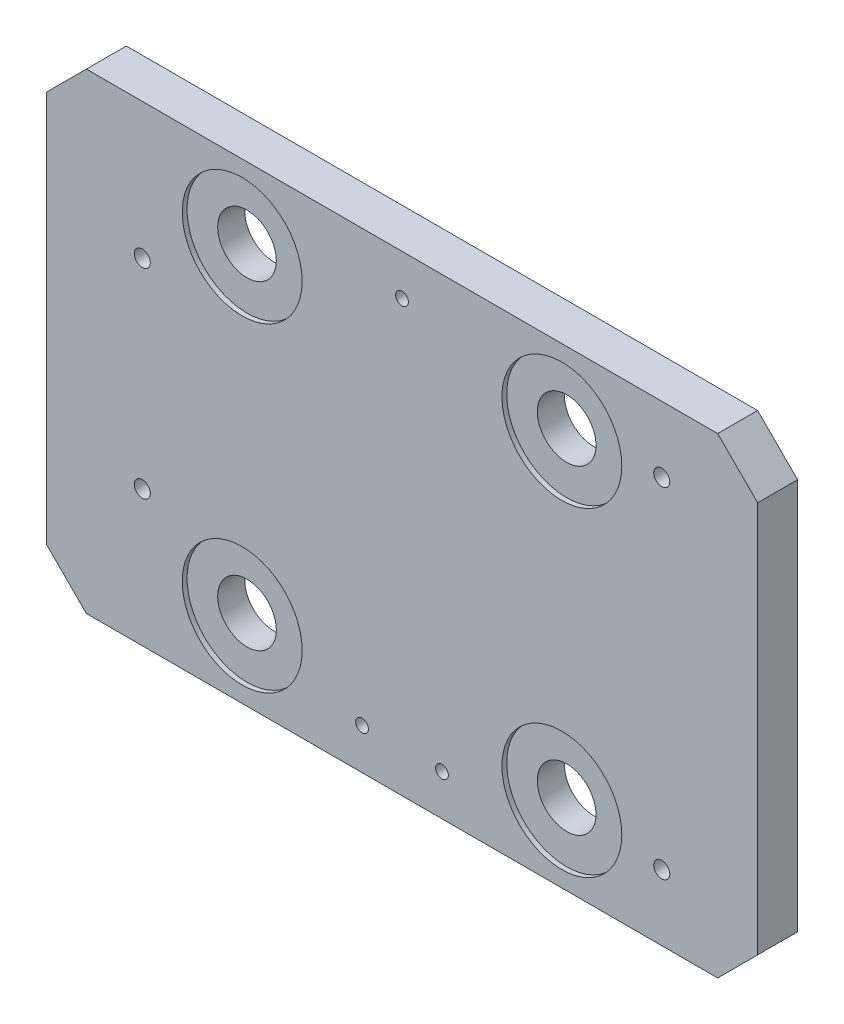
ISO-10303-21;
HEADER;
FILE_DESCRIPTION(('STEP AP214'),'2;1');
FILE_NAME('part.step','',(''),(''),'','','');
FILE_SCHEMA(('AUTOMOTIVE_DESIGN { 1 0 10303 214 1 1 1 1 }'));
ENDSEC;
DATA;
#1=APPLICATION_CONTEXT('core data for automotive mechanical design processes');
#2=APPLICATION_PROTOCOL_DEFINITION('international standard','automotive_design',2000,#1);
#3=PRODUCT_CONTEXT('',#1,'mechanical');
#4=PRODUCT('Part','Part','',(#3));
#5=PRODUCT_RELATED_PRODUCT_CATEGORY('part','',(#4));
#6=PRODUCT_DEFINITION_FORMATION('','',#4);
#7=PRODUCT_DEFINITION_CONTEXT('part definition',#1,'design');
#8=PRODUCT_DEFINITION('design','',#6,#7);
#9=PRODUCT_DEFINITION_SHAPE('','',#8);
#10=(LENGTH_UNIT() NAMED_UNIT(*) SI_UNIT(.MILLI.,.METRE.));
#11=(NAMED_UNIT(*) PLANE_ANGLE_UNIT() SI_UNIT($,.RADIAN.));
#12=(NAMED_UNIT(*) SI_UNIT($,.STERADIAN.) SOLID_ANGLE_UNIT());
#13=UNCERTAINTY_MEASURE_WITH_UNIT(LENGTH_MEASURE(1.E-05),#10,'distance_accuracy_value','');
#14=(GEOMETRIC_REPRESENTATION_CONTEXT(3) GLOBAL_UNCERTAINTY_ASSIGNED_CONTEXT((#13)) GLOBAL_UNIT_ASSIGNED_CONTEXT((#10,
#11,#12)) REPRESENTATION_CONTEXT('',''));
#15=CARTESIAN_POINT('',(0.,0.,0.));
#16=DIRECTION('',(0.,0.,1.));
#17=DIRECTION('',(1.,0.,0.));
#18=AXIS2_PLACEMENT_3D('',#15,#16,#17);
#19=CARTESIAN_POINT('',(62.23,-24.13,0.));
#20=DIRECTION('',(0.,0.,-1.));
#21=DIRECTION('',(-1.,0.,0.));
#22=AXIS2_PLACEMENT_3D('',#19,#20,#21);
#23=CYLINDRICAL_SURFACE('',#22,9.3218);
#24=CARTESIAN_POINT('',(62.23,-24.13,2.54));
#25=DIRECTION('',(0.,0.,-1.));
#26=DIRECTION('',(-1.,0.,0.));
#27=AXIS2_PLACEMENT_3D('',#24,#25,#26);
#28=CIRCLE('',#27,9.3218);
#29=CARTESIAN_POINT('',(52.9082,-24.13,2.54));
#30=VERTEX_POINT('',#29);
#31=EDGE_CURVE('E230',#30,#30,#28,.T.);
#32=ORIENTED_EDGE('',*,*,#31,.T.);
#33=EDGE_LOOP('',(#32));
#34=FACE_BOUND('',#33,.T.);
#35=CARTESIAN_POINT('',(62.23,-24.13,11.176));
#36=DIRECTION('',(0.,0.,1.));
#37=DIRECTION('',(1.,0.,0.));
#38=AXIS2_PLACEMENT_3D('',#35,#36,#37);
#39=CIRCLE('',#38,9.3218);
#40=CARTESIAN_POINT('',(71.5518,-24.13,11.176));
#41=VERTEX_POINT('',#40);
#42=EDGE_CURVE('E39',#41,#41,#39,.F.);
#43=ORIENTED_EDGE('',*,*,#42,.F.);
#44=EDGE_LOOP('',(#43));
#45=FACE_BOUND('',#44,.T.);
#46=ADVANCED_FACE('F35',(#34,#45),#23,.F.);
#47=CARTESIAN_POINT('',(163.83,-24.13,0.));
#48=DIRECTION('',(0.,0.,-1.));
#49=DIRECTION('',(-1.,0.,0.));
#50=AXIS2_PLACEMENT_3D('',#47,#48,#49);
#51=CYLINDRICAL_SURFACE('',#50,9.32179999999999);
#52=CARTESIAN_POINT('',(163.83,-24.13,2.54));
#53=DIRECTION('',(0.,0.,-1.));
#54=DIRECTION('',(-1.,0.,0.));
#55=AXIS2_PLACEMENT_3D('',#52,#53,#54);
#56=CIRCLE('',#55,9.32179999999999);
#57=CARTESIAN_POINT('',(154.5082,-24.13,2.54));
#58=VERTEX_POINT('',#57);
#59=EDGE_CURVE('E221',#58,#58,#56,.T.);
#60=ORIENTED_EDGE('',*,*,#59,.T.);
#61=EDGE_LOOP('',(#60));
#62=FACE_BOUND('',#61,.T.);
#63=CARTESIAN_POINT('',(163.83,-24.13,11.176));
#64=DIRECTION('',(0.,0.,1.));
#65=DIRECTION('',(1.,0.,0.));
#66=AXIS2_PLACEMENT_3D('',#63,#64,#65);
#67=CIRCLE('',#66,9.32179999999999);
#68=CARTESIAN_POINT('',(173.1518,-24.13,11.176));
#69=VERTEX_POINT('',#68);
#70=EDGE_CURVE('E173',#69,#69,#67,.F.);
#71=ORIENTED_EDGE('',*,*,#70,.F.);
#72=EDGE_LOOP('',(#71));
#73=FACE_BOUND('',#72,.T.);
#74=ADVANCED_FACE('F306',(#62,#73),#51,.F.);
#75=CARTESIAN_POINT('',(62.23,-125.73,0.));
#76=DIRECTION('',(0.,0.,-1.));
#77=DIRECTION('',(-1.,0.,0.));
#78=AXIS2_PLACEMENT_3D('',#75,#76,#77);
#79=CYLINDRICAL_SURFACE('',#78,9.3218);
#80=CARTESIAN_POINT('',(62.23,-125.73,2.54));
#81=DIRECTION('',(0.,0.,-1.));
#82=DIRECTION('',(-1.,0.,0.));
#83=AXIS2_PLACEMENT_3D('',#80,#81,#82);
#84=CIRCLE('',#83,9.3218);
#85=CARTESIAN_POINT('',(52.9082,-125.73,2.54));
#86=VERTEX_POINT('',#85);
#87=EDGE_CURVE('E239',#86,#86,#84,.T.);
#88=ORIENTED_EDGE('',*,*,#87,.T.);
#89=EDGE_LOOP('',(#88));
#90=FACE_BOUND('',#89,.T.);
#91=CARTESIAN_POINT('',(62.23,-125.73,11.176));
#92=DIRECTION('',(0.,0.,1.));
#93=DIRECTION('',(1.,0.,0.));
#94=AXIS2_PLACEMENT_3D('',#91,#92,#93);
#95=CIRCLE('',#94,9.3218);
#96=CARTESIAN_POINT('',(71.5518,-125.73,11.176));
#97=VERTEX_POINT('',#96);
#98=EDGE_CURVE('E169',#97,#97,#95,.F.);
#99=ORIENTED_EDGE('',*,*,#98,.F.);
#100=EDGE_LOOP('',(#99));
#101=FACE_BOUND('',#100,.T.);
#102=ADVANCED_FACE('F312',(#90,#101),#79,.F.);
#103=CARTESIAN_POINT('',(163.83,-125.73,0.));
#104=DIRECTION('',(0.,0.,-1.));
#105=DIRECTION('',(-1.,0.,0.));
#106=AXIS2_PLACEMENT_3D('',#103,#104,#105);
#107=CYLINDRICAL_SURFACE('',#106,9.32179999999999);
#108=CARTESIAN_POINT('',(163.83,-125.73,2.54));
#109=DIRECTION('',(0.,0.,-1.));
#110=DIRECTION('',(-1.,0.,0.));
#111=AXIS2_PLACEMENT_3D('',#108,#109,#110);
#112=CIRCLE('',#111,9.32179999999999);
#113=CARTESIAN_POINT('',(154.5082,-125.73,2.54));
#114=VERTEX_POINT('',#113);
#115=EDGE_CURVE('E248',#114,#114,#112,.T.);
#116=ORIENTED_EDGE('',*,*,#115,.T.);
#117=EDGE_LOOP('',(#116));
#118=FACE_BOUND('',#117,.T.);
#119=CARTESIAN_POINT('',(163.83,-125.73,11.176));
#120=DIRECTION('',(0.,0.,1.));
#121=DIRECTION('',(1.,0.,0.));
#122=AXIS2_PLACEMENT_3D('',#119,#120,#121);
#123=CIRCLE('',#122,9.32179999999999);
#124=CARTESIAN_POINT('',(173.1518,-125.73,11.176));
#125=VERTEX_POINT('',#124);
#126=EDGE_CURVE('E164',#125,#125,#123,.F.);
#127=ORIENTED_EDGE('',*,*,#126,.F.);
#128=EDGE_LOOP('',(#127));
#129=FACE_BOUND('',#128,.T.);
#130=ADVANCED_FACE('F331',(#118,#129),#107,.F.);
#131=CARTESIAN_POINT('',(0.,-149.86,0.));
#132=DIRECTION('',(0.,0.,1.));
#133=DIRECTION('',(1.,0.,0.));
#134=AXIS2_PLACEMENT_3D('',#131,#132,#133);
#135=PLANE('',#134);
#136=CARTESIAN_POINT('',(100.33,-136.8552,0.));
#137=DIRECTION('',(0.,0.,-1.));
#138=DIRECTION('',(-1.,0.,0.));
#139=AXIS2_PLACEMENT_3D('',#136,#137,#138);
#140=CIRCLE('',#139,2.01929999999999);
#141=CARTESIAN_POINT('',(98.3107,-136.8552,0.));
#142=VERTEX_POINT('',#141);
#143=EDGE_CURVE('E209',#142,#142,#140,.T.);
#144=ORIENTED_EDGE('',*,*,#143,.F.);
#145=EDGE_LOOP('',(#144));
#146=FACE_BOUND('',#145,.T.);
#147=CARTESIAN_POINT('',(163.83,-24.13,0.));
#148=DIRECTION('',(0.,0.,-1.));
#149=DIRECTION('',(-1.,0.,0.));
#150=AXIS2_PLACEMENT_3D('',#147,#148,#149);
#151=CIRCLE('',#150,19.05);
#152=CARTESIAN_POINT('',(144.78,-24.13,0.));
#153=VERTEX_POINT('',#152);
#154=EDGE_CURVE('E215',#153,#153,#151,.T.);
#155=ORIENTED_EDGE('',*,*,#154,.F.);
#156=EDGE_LOOP('',(#155));
#157=FACE_BOUND('',#156,.T.);
#158=CARTESIAN_POINT('',(62.23,-24.13,0.));
#159=DIRECTION('',(0.,0.,-1.));
#160=DIRECTION('',(-1.,0.,0.));
#161=AXIS2_PLACEMENT_3D('',#158,#159,#160);
#162=CIRCLE('',#161,19.05);
#163=CARTESIAN_POINT('',(43.18,-24.13,0.));
#164=VERTEX_POINT('',#163);
#165=EDGE_CURVE('E224',#164,#164,#162,.T.);
#166=ORIENTED_EDGE('',*,*,#165,.F.);
#167=EDGE_LOOP('',(#166));
#168=FACE_BOUND('',#167,.T.);
#169=CARTESIAN_POINT('',(62.23,-125.73,0.));
#170=DIRECTION('',(0.,0.,-1.));
#171=DIRECTION('',(-1.,0.,0.));
#172=AXIS2_PLACEMENT_3D('',#169,#170,#171);
#173=CIRCLE('',#172,19.05);
#174=CARTESIAN_POINT('',(43.18,-125.73,0.));
#175=VERTEX_POINT('',#174);
#176=EDGE_CURVE('E233',#175,#175,#173,.T.);
#177=ORIENTED_EDGE('',*,*,#176,.F.);
#178=EDGE_LOOP('',(#177));
#179=FACE_BOUND('',#178,.T.);
#180=CARTESIAN_POINT('',(163.83,-125.73,0.));
#181=DIRECTION('',(0.,0.,-1.));
#182=DIRECTION('',(-1.,0.,0.));
#183=AXIS2_PLACEMENT_3D('',#180,#181,#182);
#184=CIRCLE('',#183,19.05);
#185=CARTESIAN_POINT('',(144.78,-125.73,0.));
#186=VERTEX_POINT('',#185);
#187=EDGE_CURVE('E242',#186,#186,#184,.T.);
#188=ORIENTED_EDGE('',*,*,#187,.F.);
#189=EDGE_LOOP('',(#188));
#190=FACE_BOUND('',#189,.T.);
#191=CARTESIAN_POINT('',(195.58,-20.955,0.));
#192=DIRECTION('',(0.,0.,-1.));
#193=DIRECTION('',(-1.,0.,0.));
#194=AXIS2_PLACEMENT_3D('',#191,#192,#193);
#195=CIRCLE('',#194,2.55269999999999);
#196=CARTESIAN_POINT('',(193.0273,-20.955,0.));
#197=VERTEX_POINT('',#196);
#198=EDGE_CURVE('E251',#197,#197,#195,.T.);
#199=ORIENTED_EDGE('',*,*,#198,.F.);
#200=EDGE_LOOP('',(#199));
#201=FACE_BOUND('',#200,.T.);
#202=CARTESIAN_POINT('',(195.58,-128.905,0.));
#203=DIRECTION('',(0.,0.,-1.));
#204=DIRECTION('',(-1.,0.,0.));
#205=AXIS2_PLACEMENT_3D('',#202,#203,#204);
#206=CIRCLE('',#205,2.55269999999999);
#207=CARTESIAN_POINT('',(193.0273,-128.905,0.));
#208=VERTEX_POINT('',#207);
#209=EDGE_CURVE('E257',#208,#208,#206,.T.);
#210=ORIENTED_EDGE('',*,*,#209,.F.);
#211=EDGE_LOOP('',(#210));
#212=FACE_BOUND('',#211,.T.);
#213=CARTESIAN_POINT('',(30.4800000000001,-43.18,0.));
#214=DIRECTION('',(0.,0.,-1.));
#215=DIRECTION('',(-1.,0.,0.));
#216=AXIS2_PLACEMENT_3D('',#213,#214,#215);
#217=CIRCLE('',#216,2.5527);
#218=CARTESIAN_POINT('',(27.9273000000001,-43.18,0.));
#219=VERTEX_POINT('',#218);
#220=EDGE_CURVE('E263',#219,#219,#217,.T.);
#221=ORIENTED_EDGE('',*,*,#220,.F.);
#222=EDGE_LOOP('',(#221));
#223=FACE_BOUND('',#222,.T.);
#224=CARTESIAN_POINT('',(30.4800000000001,-106.68,0.));
#225=DIRECTION('',(0.,0.,-1.));
#226=DIRECTION('',(-1.,0.,0.));
#227=AXIS2_PLACEMENT_3D('',#224,#225,#226);
#228=CIRCLE('',#227,2.5527);
#229=CARTESIAN_POINT('',(27.9273000000001,-106.68,0.));
#230=VERTEX_POINT('',#229);
#231=EDGE_CURVE('E269',#230,#230,#228,.T.);
#232=ORIENTED_EDGE('',*,*,#231,.F.);
#233=EDGE_LOOP('',(#232));
#234=FACE_BOUND('',#233,.T.);
#235=DIRECTION('',(1.,0.,0.));
#236=VECTOR('',#235,1.);
#237=CARTESIAN_POINT('',(0.,-149.86,0.));
#238=LINE('',#237,#236);
#239=CARTESIAN_POINT('',(12.7,-149.86,0.));
#240=VERTEX_POINT('',#239);
#241=CARTESIAN_POINT('',(213.36,-149.86,0.));
#242=VERTEX_POINT('',#241);
#243=EDGE_CURVE('E120',#240,#242,#238,.T.);
#244=ORIENTED_EDGE('',*,*,#243,.F.);
#245=DIRECTION('',(0.707106781186546,-0.707106781186549,0.));
#246=VECTOR('',#245,1.);
#247=CARTESIAN_POINT('',(12.7,-149.86,0.));
#248=LINE('',#247,#246);
#249=CARTESIAN_POINT('',(0.,-137.16,0.));
#250=VERTEX_POINT('',#249);
#251=EDGE_CURVE('E103',#240,#250,#248,.F.);
#252=ORIENTED_EDGE('',*,*,#251,.T.);
#253=DIRECTION('',(0.,-1.,0.));
#254=VECTOR('',#253,1.);
#255=CARTESIAN_POINT('',(0.,0.,0.));
#256=LINE('',#255,#254);
#257=CARTESIAN_POINT('',(0.,-12.7,0.));
#258=VERTEX_POINT('',#257);
#259=EDGE_CURVE('E132',#258,#250,#256,.T.);
#260=ORIENTED_EDGE('',*,*,#259,.F.);
#261=DIRECTION('',(-0.707106781186548,-0.707106781186547,0.));
#262=VECTOR('',#261,1.);
#263=CARTESIAN_POINT('',(0.,-12.7,0.));
#264=LINE('',#263,#262);
#265=CARTESIAN_POINT('',(12.7,0.,0.));
#266=VERTEX_POINT('',#265);
#267=EDGE_CURVE('E124',#258,#266,#264,.F.);
#268=ORIENTED_EDGE('',*,*,#267,.T.);
#269=DIRECTION('',(-1.,0.,0.));
#270=VECTOR('',#269,1.);
#271=CARTESIAN_POINT('',(0.,0.,0.));
#272=LINE('',#271,#270);
#273=CARTESIAN_POINT('',(213.36,0.,0.));
#274=VERTEX_POINT('',#273);
#275=EDGE_CURVE('E135',#274,#266,#272,.T.);
#276=ORIENTED_EDGE('',*,*,#275,.F.);
#277=DIRECTION('',(-0.707106781186546,0.707106781186549,0.));
#278=VECTOR('',#277,1.);
#279=CARTESIAN_POINT('',(213.36,0.,0.));
#280=LINE('',#279,#278);
#281=CARTESIAN_POINT('',(226.06,-12.7000000000001,0.));
#282=VERTEX_POINT('',#281);
#283=EDGE_CURVE('E114',#274,#282,#280,.F.);
#284=ORIENTED_EDGE('',*,*,#283,.T.);
#285=DIRECTION('',(0.,1.,0.));
#286=VECTOR('',#285,1.);
#287=CARTESIAN_POINT('',(226.06,0.,0.));
#288=LINE('',#287,#286);
#289=CARTESIAN_POINT('',(226.06,-137.16,0.));
#290=VERTEX_POINT('',#289);
#291=EDGE_CURVE('E131',#290,#282,#288,.T.);
#292=ORIENTED_EDGE('',*,*,#291,.F.);
#293=DIRECTION('',(0.707106781186549,0.707106781186546,0.));
#294=VECTOR('',#293,1.);
#295=CARTESIAN_POINT('',(226.06,-137.16,0.));
#296=LINE('',#295,#294);
#297=EDGE_CURVE('E130',#290,#242,#296,.F.);
#298=ORIENTED_EDGE('',*,*,#297,.T.);
#299=EDGE_LOOP('',(#244,#252,#260,#268,#276,#284,#292,#298));
#300=FACE_BOUND('',#299,.T.);
#301=CARTESIAN_POINT('',(125.73,-136.8552,0.));
#302=DIRECTION('',(0.,0.,-1.));
#303=DIRECTION('',(-1.,0.,0.));
#304=AXIS2_PLACEMENT_3D('',#301,#302,#303);
#305=CIRCLE('',#304,2.01929999999997);
#306=CARTESIAN_POINT('',(123.7107,-136.8552,0.));
#307=VERTEX_POINT('',#306);
#308=EDGE_CURVE('E203',#307,#307,#305,.T.);
#309=ORIENTED_EDGE('',*,*,#308,.F.);
#310=EDGE_LOOP('',(#309));
#311=FACE_BOUND('',#310,.T.);
#312=CARTESIAN_POINT('',(113.03,-13.0048,0.));
#313=DIRECTION('',(0.,0.,-1.));
#314=DIRECTION('',(-1.,0.,0.));
#315=AXIS2_PLACEMENT_3D('',#312,#313,#314);
#316=CIRCLE('',#315,2.01929999999999);
#317=CARTESIAN_POINT('',(111.0107,-13.0048,0.));
#318=VERTEX_POINT('',#317);
#319=EDGE_CURVE('E167',#318,#318,#316,.T.);
#320=ORIENTED_EDGE('',*,*,#319,.F.);
#321=EDGE_LOOP('',(#320));
#322=FACE_BOUND('',#321,.T.);
#323=ADVANCED_FACE('F127',(#146,#157,#168,#179,#190,#201,#212,#223,#234,#300,#311,#322),#135,.F.);
#324=CARTESIAN_POINT('',(0.,0.,12.7));
#325=DIRECTION('',(1.,0.,0.));
#326=DIRECTION('',(0.,1.,0.));
#327=AXIS2_PLACEMENT_3D('',#324,#325,#326);
#328=PLANE('',#327);
#329=ORIENTED_EDGE('',*,*,#259,.T.);
#330=DIRECTION('',(0.,0.,1.));
#331=VECTOR('',#330,1.);
#332=CARTESIAN_POINT('',(0.,-137.16,12.7));
#333=LINE('',#332,#331);
#334=CARTESIAN_POINT('',(0.,-137.16,12.7));
#335=VERTEX_POINT('',#334);
#336=EDGE_CURVE('E108',#250,#335,#333,.T.);
#337=ORIENTED_EDGE('',*,*,#336,.T.);
#338=DIRECTION('',(0.,-1.,0.));
#339=VECTOR('',#338,1.);
#340=CARTESIAN_POINT('',(0.,0.,12.7));
#341=LINE('',#340,#339);
#342=CARTESIAN_POINT('',(0.,-12.7,12.7));
#343=VERTEX_POINT('',#342);
#344=EDGE_CURVE('E142',#343,#335,#341,.T.);
#345=ORIENTED_EDGE('',*,*,#344,.F.);
#346=DIRECTION('',(0.,0.,-1.));
#347=VECTOR('',#346,1.);
#348=CARTESIAN_POINT('',(0.,-12.7,12.7));
#349=LINE('',#348,#347);
#350=EDGE_CURVE('E113',#343,#258,#349,.T.);
#351=ORIENTED_EDGE('',*,*,#350,.T.);
#352=EDGE_LOOP('',(#329,#337,#345,#351));
#353=FACE_BOUND('',#352,.T.);
#354=ADVANCED_FACE('F285',(#353),#328,.F.);
#355=CARTESIAN_POINT('',(0.,-149.86,12.7));
#356=DIRECTION('',(0.,1.,0.));
#357=DIRECTION('',(0.,0.,1.));
#358=AXIS2_PLACEMENT_3D('',#355,#356,#357);
#359=PLANE('',#358);
#360=DIRECTION('',(1.,0.,0.));
#361=VECTOR('',#360,1.);
#362=CARTESIAN_POINT('',(0.,-149.86,12.7));
#363=LINE('',#362,#361);
#364=CARTESIAN_POINT('',(12.7,-149.86,12.7));
#365=VERTEX_POINT('',#364);
#366=CARTESIAN_POINT('',(213.36,-149.86,12.7));
#367=VERTEX_POINT('',#366);
#368=EDGE_CURVE('E123',#365,#367,#363,.T.);
#369=ORIENTED_EDGE('',*,*,#368,.F.);
#370=DIRECTION('',(0.,0.,-1.));
#371=VECTOR('',#370,1.);
#372=CARTESIAN_POINT('',(12.7,-149.86,12.7));
#373=LINE('',#372,#371);
#374=EDGE_CURVE('E107',#365,#240,#373,.T.);
#375=ORIENTED_EDGE('',*,*,#374,.T.);
#376=ORIENTED_EDGE('',*,*,#243,.T.);
#377=DIRECTION('',(0.,0.,1.));
#378=VECTOR('',#377,1.);
#379=CARTESIAN_POINT('',(213.36,-149.86,12.7));
#380=LINE('',#379,#378);
#381=EDGE_CURVE('E125',#242,#367,#380,.T.);
#382=ORIENTED_EDGE('',*,*,#381,.T.);
#383=EDGE_LOOP('',(#369,#375,#376,#382));
#384=FACE_BOUND('',#383,.T.);
#385=ADVANCED_FACE('F119',(#384),#359,.F.);
#386=CARTESIAN_POINT('',(226.06,0.,12.7));
#387=DIRECTION('',(-1.,0.,0.));
#388=DIRECTION('',(0.,-1.,0.));
#389=AXIS2_PLACEMENT_3D('',#386,#387,#388);
#390=PLANE('',#389);
#391=ORIENTED_EDGE('',*,*,#291,.T.);
#392=DIRECTION('',(0.,0.,1.));
#393=VECTOR('',#392,1.);
#394=CARTESIAN_POINT('',(226.06,-12.7000000000001,12.7));
#395=LINE('',#394,#393);
#396=CARTESIAN_POINT('',(226.06,-12.7,12.7));
#397=VERTEX_POINT('',#396);
#398=EDGE_CURVE('E11',#282,#397,#395,.T.);
#399=ORIENTED_EDGE('',*,*,#398,.T.);
#400=DIRECTION('',(0.,1.,0.));
#401=VECTOR('',#400,1.);
#402=CARTESIAN_POINT('',(226.06,0.,12.7));
#403=LINE('',#402,#401);
#404=CARTESIAN_POINT('',(226.06,-137.16,12.7));
#405=VERTEX_POINT('',#404);
#406=EDGE_CURVE('E277',#405,#397,#403,.T.);
#407=ORIENTED_EDGE('',*,*,#406,.F.);
#408=DIRECTION('',(0.,0.,-1.));
#409=VECTOR('',#408,1.);
#410=CARTESIAN_POINT('',(226.06,-137.16,12.7));
#411=LINE('',#410,#409);
#412=EDGE_CURVE('E44',#405,#290,#411,.T.);
#413=ORIENTED_EDGE('',*,*,#412,.T.);
#414=EDGE_LOOP('',(#391,#399,#407,#413));
#415=FACE_BOUND('',#414,.T.);
#416=ADVANCED_FACE('F292',(#415),#390,.F.);
#417=CARTESIAN_POINT('',(0.,0.,12.7));
#418=DIRECTION('',(0.,-1.,0.));
#419=DIRECTION('',(0.,0.,-1.));
#420=AXIS2_PLACEMENT_3D('',#417,#418,#419);
#421=PLANE('',#420);
#422=DIRECTION('',(-1.,0.,0.));
#423=VECTOR('',#422,1.);
#424=CARTESIAN_POINT('',(0.,0.,12.7));
#425=LINE('',#424,#423);
#426=CARTESIAN_POINT('',(213.36,0.,12.7));
#427=VERTEX_POINT('',#426);
#428=CARTESIAN_POINT('',(12.7,0.,12.7));
#429=VERTEX_POINT('',#428);
#430=EDGE_CURVE('E143',#427,#429,#425,.T.);
#431=ORIENTED_EDGE('',*,*,#430,.F.);
#432=DIRECTION('',(0.,0.,-1.));
#433=VECTOR('',#432,1.);
#434=CARTESIAN_POINT('',(213.36,0.,12.7));
#435=LINE('',#434,#433);
#436=EDGE_CURVE('E159',#427,#274,#435,.T.);
#437=ORIENTED_EDGE('',*,*,#436,.T.);
#438=ORIENTED_EDGE('',*,*,#275,.T.);
#439=DIRECTION('',(0.,0.,1.));
#440=VECTOR('',#439,1.);
#441=CARTESIAN_POINT('',(12.7,0.,12.7));
#442=LINE('',#441,#440);
#443=EDGE_CURVE('E52',#266,#429,#442,.T.);
#444=ORIENTED_EDGE('',*,*,#443,.T.);
#445=EDGE_LOOP('',(#431,#437,#438,#444));
#446=FACE_BOUND('',#445,.T.);
#447=ADVANCED_FACE('F287',(#446),#421,.F.);
#448=CARTESIAN_POINT('',(0.,-149.86,12.7));
#449=DIRECTION('',(0.,0.,1.));
#450=DIRECTION('',(1.,0.,0.));
#451=AXIS2_PLACEMENT_3D('',#448,#449,#450);
#452=PLANE('',#451);
#453=CARTESIAN_POINT('',(62.2300000000001,-24.13,12.7));
#454=DIRECTION('',(0.,0.,1.));
#455=DIRECTION('',(1.,0.,0.));
#456=AXIS2_PLACEMENT_3D('',#453,#454,#455);
#457=CIRCLE('',#456,19.05);
#458=CARTESIAN_POINT('',(81.2800000000001,-24.13,12.7));
#459=VERTEX_POINT('',#458);
#460=EDGE_CURVE('E189',#459,#459,#457,.T.);
#461=ORIENTED_EDGE('',*,*,#460,.F.);
#462=EDGE_LOOP('',(#461));
#463=FACE_BOUND('',#462,.T.);
#464=CARTESIAN_POINT('',(163.83,-24.13,12.7));
#465=DIRECTION('',(0.,0.,1.));
#466=DIRECTION('',(1.,0.,0.));
#467=AXIS2_PLACEMENT_3D('',#464,#465,#466);
#468=CIRCLE('',#467,19.05);
#469=CARTESIAN_POINT('',(182.88,-24.13,12.7));
#470=VERTEX_POINT('',#469);
#471=EDGE_CURVE('E182',#470,#470,#468,.T.);
#472=ORIENTED_EDGE('',*,*,#471,.F.);
#473=EDGE_LOOP('',(#472));
#474=FACE_BOUND('',#473,.T.);
#475=CARTESIAN_POINT('',(62.2300000000001,-125.73,12.7));
#476=DIRECTION('',(0.,0.,1.));
#477=DIRECTION('',(1.,0.,0.));
#478=AXIS2_PLACEMENT_3D('',#475,#476,#477);
#479=CIRCLE('',#478,19.05);
#480=CARTESIAN_POINT('',(81.2800000000001,-125.73,12.7));
#481=VERTEX_POINT('',#480);
#482=EDGE_CURVE('E175',#481,#481,#479,.T.);
#483=ORIENTED_EDGE('',*,*,#482,.F.);
#484=EDGE_LOOP('',(#483));
#485=FACE_BOUND('',#484,.T.);
#486=CARTESIAN_POINT('',(163.83,-125.73,12.7));
#487=DIRECTION('',(0.,0.,1.));
#488=DIRECTION('',(1.,0.,0.));
#489=AXIS2_PLACEMENT_3D('',#486,#487,#488);
#490=CIRCLE('',#489,19.05);
#491=CARTESIAN_POINT('',(182.88,-125.73,12.7));
#492=VERTEX_POINT('',#491);
#493=EDGE_CURVE('E171',#492,#492,#490,.T.);
#494=ORIENTED_EDGE('',*,*,#493,.F.);
#495=EDGE_LOOP('',(#494));
#496=FACE_BOUND('',#495,.T.);
#497=CARTESIAN_POINT('',(113.03,-13.0048,12.7));
#498=DIRECTION('',(0.,0.,-1.));
#499=DIRECTION('',(-1.,0.,0.));
#500=AXIS2_PLACEMENT_3D('',#497,#498,#499);
#501=CIRCLE('',#500,2.0193);
#502=CARTESIAN_POINT('',(111.0107,-13.0048,12.7));
#503=VERTEX_POINT('',#502);
#504=EDGE_CURVE('E200',#503,#503,#501,.T.);
#505=ORIENTED_EDGE('',*,*,#504,.T.);
#506=EDGE_LOOP('',(#505));
#507=FACE_BOUND('',#506,.T.);
#508=CARTESIAN_POINT('',(125.73,-136.8552,12.7));
#509=DIRECTION('',(0.,0.,-1.));
#510=DIRECTION('',(-1.,0.,0.));
#511=AXIS2_PLACEMENT_3D('',#508,#509,#510);
#512=CIRCLE('',#511,2.0193);
#513=CARTESIAN_POINT('',(123.7107,-136.8552,12.7));
#514=VERTEX_POINT('',#513);
#515=EDGE_CURVE('E206',#514,#514,#512,.T.);
#516=ORIENTED_EDGE('',*,*,#515,.T.);
#517=EDGE_LOOP('',(#516));
#518=FACE_BOUND('',#517,.T.);
#519=CARTESIAN_POINT('',(100.33,-136.8552,12.7));
#520=DIRECTION('',(0.,0.,-1.));
#521=DIRECTION('',(-1.,0.,0.));
#522=AXIS2_PLACEMENT_3D('',#519,#520,#521);
#523=CIRCLE('',#522,2.0193);
#524=CARTESIAN_POINT('',(98.3107,-136.8552,12.7));
#525=VERTEX_POINT('',#524);
#526=EDGE_CURVE('E212',#525,#525,#523,.T.);
#527=ORIENTED_EDGE('',*,*,#526,.T.);
#528=EDGE_LOOP('',(#527));
#529=FACE_BOUND('',#528,.T.);
#530=CARTESIAN_POINT('',(195.58,-20.955,12.7));
#531=DIRECTION('',(0.,0.,-1.));
#532=DIRECTION('',(-1.,0.,0.));
#533=AXIS2_PLACEMENT_3D('',#530,#531,#532);
#534=CIRCLE('',#533,2.55269999999999);
#535=CARTESIAN_POINT('',(193.0273,-20.955,12.7));
#536=VERTEX_POINT('',#535);
#537=EDGE_CURVE('E254',#536,#536,#534,.T.);
#538=ORIENTED_EDGE('',*,*,#537,.T.);
#539=EDGE_LOOP('',(#538));
#540=FACE_BOUND('',#539,.T.);
#541=CARTESIAN_POINT('',(195.58,-128.905,12.7));
#542=DIRECTION('',(0.,0.,-1.));
#543=DIRECTION('',(-1.,0.,0.));
#544=AXIS2_PLACEMENT_3D('',#541,#542,#543);
#545=CIRCLE('',#544,2.55269999999999);
#546=CARTESIAN_POINT('',(193.0273,-128.905,12.7));
#547=VERTEX_POINT('',#546);
#548=EDGE_CURVE('E260',#547,#547,#545,.T.);
#549=ORIENTED_EDGE('',*,*,#548,.T.);
#550=EDGE_LOOP('',(#549));
#551=FACE_BOUND('',#550,.T.);
#552=CARTESIAN_POINT('',(30.4800000000001,-43.18,12.7));
#553=DIRECTION('',(0.,0.,-1.));
#554=DIRECTION('',(-1.,0.,0.));
#555=AXIS2_PLACEMENT_3D('',#552,#553,#554);
#556=CIRCLE('',#555,2.5527);
#557=CARTESIAN_POINT('',(27.9273000000001,-43.18,12.7));
#558=VERTEX_POINT('',#557);
#559=EDGE_CURVE('E266',#558,#558,#556,.T.);
#560=ORIENTED_EDGE('',*,*,#559,.T.);
#561=EDGE_LOOP('',(#560));
#562=FACE_BOUND('',#561,.T.);
#563=CARTESIAN_POINT('',(30.4800000000001,-106.68,12.7));
#564=DIRECTION('',(0.,0.,-1.));
#565=DIRECTION('',(-1.,0.,0.));
#566=AXIS2_PLACEMENT_3D('',#563,#564,#565);
#567=CIRCLE('',#566,2.5527);
#568=CARTESIAN_POINT('',(27.9273000000001,-106.68,12.7));
#569=VERTEX_POINT('',#568);
#570=EDGE_CURVE('E137',#569,#569,#567,.T.);
#571=ORIENTED_EDGE('',*,*,#570,.T.);
#572=EDGE_LOOP('',(#571));
#573=FACE_BOUND('',#572,.T.);
#574=ORIENTED_EDGE('',*,*,#344,.T.);
#575=DIRECTION('',(-0.707106781186546,0.707106781186549,0.));
#576=VECTOR('',#575,1.);
#577=CARTESIAN_POINT('',(6.35000000000004,-143.51,12.7));
#578=LINE('',#577,#576);
#579=EDGE_CURVE('E156',#335,#365,#578,.F.);
#580=ORIENTED_EDGE('',*,*,#579,.T.);
#581=ORIENTED_EDGE('',*,*,#368,.T.);
#582=DIRECTION('',(-0.707106781186549,-0.707106781186546,0.));
#583=VECTOR('',#582,1.);
#584=CARTESIAN_POINT('',(106.68,-256.54,12.7));
#585=LINE('',#584,#583);
#586=EDGE_CURVE('E153',#367,#405,#585,.F.);
#587=ORIENTED_EDGE('',*,*,#586,.T.);
#588=ORIENTED_EDGE('',*,*,#406,.T.);
#589=DIRECTION('',(0.707106781186546,-0.707106781186549,0.));
#590=VECTOR('',#589,1.);
#591=CARTESIAN_POINT('',(181.610000000001,31.7499999999997,12.7));
#592=LINE('',#591,#590);
#593=EDGE_CURVE('E59',#397,#427,#592,.F.);
#594=ORIENTED_EDGE('',*,*,#593,.T.);
#595=ORIENTED_EDGE('',*,*,#430,.T.);
#596=DIRECTION('',(0.707106781186548,0.707106781186547,0.));
#597=VECTOR('',#596,1.);
#598=CARTESIAN_POINT('',(-68.58,-81.2799999999998,12.7));
#599=LINE('',#598,#597);
#600=EDGE_CURVE('E151',#429,#343,#599,.F.);
#601=ORIENTED_EDGE('',*,*,#600,.T.);
#602=EDGE_LOOP('',(#574,#580,#581,#587,#588,#594,#595,#601));
#603=FACE_BOUND('',#602,.T.);
#604=ADVANCED_FACE('F279',(#463,#474,#485,#496,#507,#518,#529,#540,#551,#562,#573,#603),#452,.T.);
#605=CARTESIAN_POINT('',(30.4800000000001,-106.68,0.));
#606=DIRECTION('',(0.,0.,-1.));
#607=DIRECTION('',(-1.,0.,0.));
#608=AXIS2_PLACEMENT_3D('',#605,#606,#607);
#609=CYLINDRICAL_SURFACE('',#608,2.5527);
#610=ORIENTED_EDGE('',*,*,#570,.F.);
#611=EDGE_LOOP('',(#610));
#612=FACE_BOUND('',#611,.T.);
#613=ORIENTED_EDGE('',*,*,#231,.T.);
#614=EDGE_LOOP('',(#613));
#615=FACE_BOUND('',#614,.T.);
#616=ADVANCED_FACE('F354',(#612,#615),#609,.F.);
#617=CARTESIAN_POINT('',(30.4800000000001,-43.18,0.));
#618=DIRECTION('',(0.,0.,-1.));
#619=DIRECTION('',(-1.,0.,0.));
#620=AXIS2_PLACEMENT_3D('',#617,#618,#619);
#621=CYLINDRICAL_SURFACE('',#620,2.5527);
#622=ORIENTED_EDGE('',*,*,#559,.F.);
#623=EDGE_LOOP('',(#622));
#624=FACE_BOUND('',#623,.T.);
#625=ORIENTED_EDGE('',*,*,#220,.T.);
#626=EDGE_LOOP('',(#625));
#627=FACE_BOUND('',#626,.T.);
#628=ADVANCED_FACE('F350',(#624,#627),#621,.F.);
#629=CARTESIAN_POINT('',(195.58,-128.905,0.));
#630=DIRECTION('',(0.,0.,-1.));
#631=DIRECTION('',(-1.,0.,0.));
#632=AXIS2_PLACEMENT_3D('',#629,#630,#631);
#633=CYLINDRICAL_SURFACE('',#632,2.55269999999999);
#634=ORIENTED_EDGE('',*,*,#548,.F.);
#635=EDGE_LOOP('',(#634));
#636=FACE_BOUND('',#635,.T.);
#637=ORIENTED_EDGE('',*,*,#209,.T.);
#638=EDGE_LOOP('',(#637));
#639=FACE_BOUND('',#638,.T.);
#640=ADVANCED_FACE('F346',(#636,#639),#633,.F.);
#641=CARTESIAN_POINT('',(195.58,-20.955,0.));
#642=DIRECTION('',(0.,0.,-1.));
#643=DIRECTION('',(-1.,0.,0.));
#644=AXIS2_PLACEMENT_3D('',#641,#642,#643);
#645=CYLINDRICAL_SURFACE('',#644,2.55269999999999);
#646=ORIENTED_EDGE('',*,*,#537,.F.);
#647=EDGE_LOOP('',(#646));
#648=FACE_BOUND('',#647,.T.);
#649=ORIENTED_EDGE('',*,*,#198,.T.);
#650=EDGE_LOOP('',(#649));
#651=FACE_BOUND('',#650,.T.);
#652=ADVANCED_FACE('F339',(#648,#651),#645,.F.);
#653=CARTESIAN_POINT('',(173.1518,-125.73,2.54));
#654=DIRECTION('',(0.,0.,1.));
#655=DIRECTION('',(1.,0.,0.));
#656=AXIS2_PLACEMENT_3D('',#653,#654,#655);
#657=PLANE('',#656);
#658=ORIENTED_EDGE('',*,*,#115,.F.);
#659=EDGE_LOOP('',(#658));
#660=FACE_BOUND('',#659,.T.);
#661=CARTESIAN_POINT('',(163.83,-125.73,2.54));
#662=DIRECTION('',(0.,0.,-1.));
#663=DIRECTION('',(-1.,0.,0.));
#664=AXIS2_PLACEMENT_3D('',#661,#662,#663);
#665=CIRCLE('',#664,19.05);
#666=CARTESIAN_POINT('',(144.78,-125.73,2.54));
#667=VERTEX_POINT('',#666);
#668=EDGE_CURVE('E245',#667,#667,#665,.T.);
#669=ORIENTED_EDGE('',*,*,#668,.T.);
#670=EDGE_LOOP('',(#669));
#671=FACE_BOUND('',#670,.T.);
#672=ADVANCED_FACE('F335',(#660,#671),#657,.F.);
#673=CARTESIAN_POINT('',(163.83,-125.73,0.));
#674=DIRECTION('',(0.,0.,-1.));
#675=DIRECTION('',(-1.,0.,0.));
#676=AXIS2_PLACEMENT_3D('',#673,#674,#675);
#677=CYLINDRICAL_SURFACE('',#676,19.05);
#678=ORIENTED_EDGE('',*,*,#668,.F.);
#679=EDGE_LOOP('',(#678));
#680=FACE_BOUND('',#679,.T.);
#681=ORIENTED_EDGE('',*,*,#187,.T.);
#682=EDGE_LOOP('',(#681));
#683=FACE_BOUND('',#682,.T.);
#684=ADVANCED_FACE('F327',(#680,#683),#677,.F.);
#685=CARTESIAN_POINT('',(71.5518,-125.73,2.54));
#686=DIRECTION('',(0.,0.,1.));
#687=DIRECTION('',(1.,0.,0.));
#688=AXIS2_PLACEMENT_3D('',#685,#686,#687);
#689=PLANE('',#688);
#690=ORIENTED_EDGE('',*,*,#87,.F.);
#691=EDGE_LOOP('',(#690));
#692=FACE_BOUND('',#691,.T.);
#693=CARTESIAN_POINT('',(62.23,-125.73,2.54));
#694=DIRECTION('',(0.,0.,-1.));
#695=DIRECTION('',(-1.,0.,0.));
#696=AXIS2_PLACEMENT_3D('',#693,#694,#695);
#697=CIRCLE('',#696,19.05);
#698=CARTESIAN_POINT('',(43.18,-125.73,2.54));
#699=VERTEX_POINT('',#698);
#700=EDGE_CURVE('E236',#699,#699,#697,.T.);
#701=ORIENTED_EDGE('',*,*,#700,.T.);
#702=EDGE_LOOP('',(#701));
#703=FACE_BOUND('',#702,.T.);
#704=ADVANCED_FACE('F323',(#692,#703),#689,.F.);
#705=CARTESIAN_POINT('',(62.23,-125.73,0.));
#706=DIRECTION('',(0.,0.,-1.));
#707=DIRECTION('',(-1.,0.,0.));
#708=AXIS2_PLACEMENT_3D('',#705,#706,#707);
#709=CYLINDRICAL_SURFACE('',#708,19.05);
#710=ORIENTED_EDGE('',*,*,#700,.F.);
#711=EDGE_LOOP('',(#710));
#712=FACE_BOUND('',#711,.T.);
#713=ORIENTED_EDGE('',*,*,#176,.T.);
#714=EDGE_LOOP('',(#713));
#715=FACE_BOUND('',#714,.T.);
#716=ADVANCED_FACE('F320',(#712,#715),#709,.F.);
#717=CARTESIAN_POINT('',(71.5518,-24.13,2.54));
#718=DIRECTION('',(0.,0.,1.));
#719=DIRECTION('',(1.,0.,0.));
#720=AXIS2_PLACEMENT_3D('',#717,#718,#719);
#721=PLANE('',#720);
#722=ORIENTED_EDGE('',*,*,#31,.F.);
#723=EDGE_LOOP('',(#722));
#724=FACE_BOUND('',#723,.T.);
#725=CARTESIAN_POINT('',(62.23,-24.13,2.54));
#726=DIRECTION('',(0.,0.,-1.));
#727=DIRECTION('',(-1.,0.,0.));
#728=AXIS2_PLACEMENT_3D('',#725,#726,#727);
#729=CIRCLE('',#728,19.05);
#730=CARTESIAN_POINT('',(43.18,-24.13,2.54));
#731=VERTEX_POINT('',#730);
#732=EDGE_CURVE('E227',#731,#731,#729,.T.);
#733=ORIENTED_EDGE('',*,*,#732,.T.);
#734=EDGE_LOOP('',(#733));
#735=FACE_BOUND('',#734,.T.);
#736=ADVANCED_FACE('F318',(#724,#735),#721,.F.);
#737=CARTESIAN_POINT('',(62.23,-24.13,0.));
#738=DIRECTION('',(0.,0.,-1.));
#739=DIRECTION('',(-1.,0.,0.));
#740=AXIS2_PLACEMENT_3D('',#737,#738,#739);
#741=CYLINDRICAL_SURFACE('',#740,19.05);
#742=ORIENTED_EDGE('',*,*,#732,.F.);
#743=EDGE_LOOP('',(#742));
#744=FACE_BOUND('',#743,.T.);
#745=ORIENTED_EDGE('',*,*,#165,.T.);
#746=EDGE_LOOP('',(#745));
#747=FACE_BOUND('',#746,.T.);
#748=ADVANCED_FACE('F402',(#744,#747),#741,.F.);
#749=CARTESIAN_POINT('',(173.1518,-24.13,2.54));
#750=DIRECTION('',(0.,0.,1.));
#751=DIRECTION('',(1.,0.,0.));
#752=AXIS2_PLACEMENT_3D('',#749,#750,#751);
#753=PLANE('',#752);
#754=ORIENTED_EDGE('',*,*,#59,.F.);
#755=EDGE_LOOP('',(#754));
#756=FACE_BOUND('',#755,.T.);
#757=CARTESIAN_POINT('',(163.83,-24.13,2.54));
#758=DIRECTION('',(0.,0.,-1.));
#759=DIRECTION('',(-1.,0.,0.));
#760=AXIS2_PLACEMENT_3D('',#757,#758,#759);
#761=CIRCLE('',#760,19.05);
#762=CARTESIAN_POINT('',(144.78,-24.13,2.54));
#763=VERTEX_POINT('',#762);
#764=EDGE_CURVE('E218',#763,#763,#761,.T.);
#765=ORIENTED_EDGE('',*,*,#764,.T.);
#766=EDGE_LOOP('',(#765));
#767=FACE_BOUND('',#766,.T.);
#768=ADVANCED_FACE('F399',(#756,#767),#753,.F.);
#769=CARTESIAN_POINT('',(163.83,-24.13,0.));
#770=DIRECTION('',(0.,0.,-1.));
#771=DIRECTION('',(-1.,0.,0.));
#772=AXIS2_PLACEMENT_3D('',#769,#770,#771);
#773=CYLINDRICAL_SURFACE('',#772,19.05);
#774=ORIENTED_EDGE('',*,*,#764,.F.);
#775=EDGE_LOOP('',(#774));
#776=FACE_BOUND('',#775,.T.);
#777=ORIENTED_EDGE('',*,*,#154,.T.);
#778=EDGE_LOOP('',(#777));
#779=FACE_BOUND('',#778,.T.);
#780=ADVANCED_FACE('F395',(#776,#779),#773,.F.);
#781=CARTESIAN_POINT('',(100.33,-136.8552,0.));
#782=DIRECTION('',(0.,0.,-1.));
#783=DIRECTION('',(-1.,0.,0.));
#784=AXIS2_PLACEMENT_3D('',#781,#782,#783);
#785=CYLINDRICAL_SURFACE('',#784,2.01929999999999);
#786=ORIENTED_EDGE('',*,*,#526,.F.);
#787=EDGE_LOOP('',(#786));
#788=FACE_BOUND('',#787,.T.);
#789=ORIENTED_EDGE('',*,*,#143,.T.);
#790=EDGE_LOOP('',(#789));
#791=FACE_BOUND('',#790,.T.);
#792=ADVANCED_FACE('F384',(#788,#791),#785,.F.);
#793=CARTESIAN_POINT('',(125.73,-136.8552,0.));
#794=DIRECTION('',(0.,0.,-1.));
#795=DIRECTION('',(-1.,0.,0.));
#796=AXIS2_PLACEMENT_3D('',#793,#794,#795);
#797=CYLINDRICAL_SURFACE('',#796,2.01929999999999);
#798=ORIENTED_EDGE('',*,*,#515,.F.);
#799=EDGE_LOOP('',(#798));
#800=FACE_BOUND('',#799,.T.);
#801=ORIENTED_EDGE('',*,*,#308,.T.);
#802=EDGE_LOOP('',(#801));
#803=FACE_BOUND('',#802,.T.);
#804=ADVANCED_FACE('F378',(#800,#803),#797,.F.);
#805=CARTESIAN_POINT('',(113.03,-13.0048,0.));
#806=DIRECTION('',(0.,0.,-1.));
#807=DIRECTION('',(-1.,0.,0.));
#808=AXIS2_PLACEMENT_3D('',#805,#806,#807);
#809=CYLINDRICAL_SURFACE('',#808,2.01929999999999);
#810=ORIENTED_EDGE('',*,*,#504,.F.);
#811=EDGE_LOOP('',(#810));
#812=FACE_BOUND('',#811,.T.);
#813=ORIENTED_EDGE('',*,*,#319,.T.);
#814=EDGE_LOOP('',(#813));
#815=FACE_BOUND('',#814,.T.);
#816=ADVANCED_FACE('F374',(#812,#815),#809,.F.);
#817=CARTESIAN_POINT('',(12.7,-149.86,12.7));
#818=DIRECTION('',(0.707106781186549,0.707106781186546,0.));
#819=DIRECTION('',(-0.707106781186546,0.707106781186549,0.));
#820=AXIS2_PLACEMENT_3D('',#817,#818,#819);
#821=PLANE('',#820);
#822=ORIENTED_EDGE('',*,*,#579,.F.);
#823=ORIENTED_EDGE('',*,*,#336,.F.);
#824=ORIENTED_EDGE('',*,*,#251,.F.);
#825=ORIENTED_EDGE('',*,*,#374,.F.);
#826=EDGE_LOOP('',(#822,#823,#824,#825));
#827=FACE_BOUND('',#826,.T.);
#828=ADVANCED_FACE('F106',(#827),#821,.F.);
#829=CARTESIAN_POINT('',(213.36,0.,12.7));
#830=DIRECTION('',(-0.707106781186549,-0.707106781186546,0.));
#831=DIRECTION('',(0.707106781186546,-0.707106781186549,0.));
#832=AXIS2_PLACEMENT_3D('',#829,#830,#831);
#833=PLANE('',#832);
#834=ORIENTED_EDGE('',*,*,#593,.F.);
#835=ORIENTED_EDGE('',*,*,#398,.F.);
#836=ORIENTED_EDGE('',*,*,#283,.F.);
#837=ORIENTED_EDGE('',*,*,#436,.F.);
#838=EDGE_LOOP('',(#834,#835,#836,#837));
#839=FACE_BOUND('',#838,.T.);
#840=ADVANCED_FACE('F289',(#839),#833,.F.);
#841=CARTESIAN_POINT('',(226.06,-137.16,12.7));
#842=DIRECTION('',(-0.707106781186546,0.707106781186549,0.));
#843=DIRECTION('',(-0.707106781186549,-0.707106781186546,0.));
#844=AXIS2_PLACEMENT_3D('',#841,#842,#843);
#845=PLANE('',#844);
#846=ORIENTED_EDGE('',*,*,#586,.F.);
#847=ORIENTED_EDGE('',*,*,#381,.F.);
#848=ORIENTED_EDGE('',*,*,#297,.F.);
#849=ORIENTED_EDGE('',*,*,#412,.F.);
#850=EDGE_LOOP('',(#846,#847,#848,#849));
#851=FACE_BOUND('',#850,.T.);
#852=ADVANCED_FACE('F297',(#851),#845,.F.);
#853=CARTESIAN_POINT('',(0.,-12.7,12.7));
#854=DIRECTION('',(0.707106781186547,-0.707106781186548,0.));
#855=DIRECTION('',(0.707106781186548,0.707106781186547,0.));
#856=AXIS2_PLACEMENT_3D('',#853,#854,#855);
#857=PLANE('',#856);
#858=ORIENTED_EDGE('',*,*,#600,.F.);
#859=ORIENTED_EDGE('',*,*,#443,.F.);
#860=ORIENTED_EDGE('',*,*,#267,.F.);
#861=ORIENTED_EDGE('',*,*,#350,.F.);
#862=EDGE_LOOP('',(#858,#859,#860,#861));
#863=FACE_BOUND('',#862,.T.);
#864=ADVANCED_FACE('F37',(#863),#857,.F.);
#865=CARTESIAN_POINT('',(163.83,-125.73,11.176));
#866=DIRECTION('',(0.,0.,1.));
#867=DIRECTION('',(1.,0.,0.));
#868=AXIS2_PLACEMENT_3D('',#865,#866,#867);
#869=PLANE('',#868);
#870=CARTESIAN_POINT('',(163.83,-125.73,11.176));
#871=DIRECTION('',(0.,0.,1.));
#872=DIRECTION('',(1.,0.,0.));
#873=AXIS2_PLACEMENT_3D('',#870,#871,#872);
#874=CIRCLE('',#873,19.05);
#875=CARTESIAN_POINT('',(182.88,-125.73,11.176));
#876=VERTEX_POINT('',#875);
#877=EDGE_CURVE('E168',#876,#876,#874,.T.);
#878=ORIENTED_EDGE('',*,*,#877,.T.);
#879=EDGE_LOOP('',(#878));
#880=FACE_BOUND('',#879,.T.);
#881=ORIENTED_EDGE('',*,*,#126,.T.);
#882=EDGE_LOOP('',(#881));
#883=FACE_BOUND('',#882,.T.);
#884=ADVANCED_FACE('F303',(#880,#883),#869,.T.);
#885=CARTESIAN_POINT('',(163.83,-125.73,11.176));
#886=DIRECTION('',(0.,0.,1.));
#887=DIRECTION('',(1.,0.,0.));
#888=AXIS2_PLACEMENT_3D('',#885,#886,#887);
#889=CYLINDRICAL_SURFACE('',#888,19.05);
#890=ORIENTED_EDGE('',*,*,#877,.F.);
#891=EDGE_LOOP('',(#890));
#892=FACE_BOUND('',#891,.T.);
#893=ORIENTED_EDGE('',*,*,#493,.T.);
#894=EDGE_LOOP('',(#893));
#895=FACE_BOUND('',#894,.T.);
#896=ADVANCED_FACE('F390',(#892,#895),#889,.F.);
#897=CARTESIAN_POINT('',(62.2300000000001,-125.73,11.176));
#898=DIRECTION('',(0.,0.,1.));
#899=DIRECTION('',(1.,0.,0.));
#900=AXIS2_PLACEMENT_3D('',#897,#898,#899);
#901=PLANE('',#900);
#902=CARTESIAN_POINT('',(62.2300000000001,-125.73,11.176));
#903=DIRECTION('',(0.,0.,1.));
#904=DIRECTION('',(1.,0.,0.));
#905=AXIS2_PLACEMENT_3D('',#902,#903,#904);
#906=CIRCLE('',#905,19.05);
#907=CARTESIAN_POINT('',(81.2800000000001,-125.73,11.176));
#908=VERTEX_POINT('',#907);
#909=EDGE_CURVE('E172',#908,#908,#906,.T.);
#910=ORIENTED_EDGE('',*,*,#909,.T.);
#911=EDGE_LOOP('',(#910));
#912=FACE_BOUND('',#911,.T.);
#913=ORIENTED_EDGE('',*,*,#98,.T.);
#914=EDGE_LOOP('',(#913));
#915=FACE_BOUND('',#914,.T.);
#916=ADVANCED_FACE('F604',(#912,#915),#901,.T.);
#917=CARTESIAN_POINT('',(62.2300000000001,-125.73,11.176));
#918=DIRECTION('',(0.,0.,1.));
#919=DIRECTION('',(1.,0.,0.));
#920=AXIS2_PLACEMENT_3D('',#917,#918,#919);
#921=CYLINDRICAL_SURFACE('',#920,19.05);
#922=ORIENTED_EDGE('',*,*,#909,.F.);
#923=EDGE_LOOP('',(#922));
#924=FACE_BOUND('',#923,.T.);
#925=ORIENTED_EDGE('',*,*,#482,.T.);
#926=EDGE_LOOP('',(#925));
#927=FACE_BOUND('',#926,.T.);
#928=ADVANCED_FACE('F611',(#924,#927),#921,.F.);
#929=CARTESIAN_POINT('',(163.83,-24.13,11.176));
#930=DIRECTION('',(0.,0.,1.));
#931=DIRECTION('',(1.,0.,0.));
#932=AXIS2_PLACEMENT_3D('',#929,#930,#931);
#933=PLANE('',#932);
#934=CARTESIAN_POINT('',(163.83,-24.13,11.176));
#935=DIRECTION('',(0.,0.,1.));
#936=DIRECTION('',(1.,0.,0.));
#937=AXIS2_PLACEMENT_3D('',#934,#935,#936);
#938=CIRCLE('',#937,19.05);
#939=CARTESIAN_POINT('',(182.88,-24.13,11.176));
#940=VERTEX_POINT('',#939);
#941=EDGE_CURVE('E176',#940,#940,#938,.T.);
#942=ORIENTED_EDGE('',*,*,#941,.T.);
#943=EDGE_LOOP('',(#942));
#944=FACE_BOUND('',#943,.T.);
#945=ORIENTED_EDGE('',*,*,#70,.T.);
#946=EDGE_LOOP('',(#945));
#947=FACE_BOUND('',#946,.T.);
#948=ADVANCED_FACE('F619',(#944,#947),#933,.T.);
#949=CARTESIAN_POINT('',(163.83,-24.13,11.176));
#950=DIRECTION('',(0.,0.,1.));
#951=DIRECTION('',(1.,0.,0.));
#952=AXIS2_PLACEMENT_3D('',#949,#950,#951);
#953=CYLINDRICAL_SURFACE('',#952,19.05);
#954=ORIENTED_EDGE('',*,*,#941,.F.);
#955=EDGE_LOOP('',(#954));
#956=FACE_BOUND('',#955,.T.);
#957=ORIENTED_EDGE('',*,*,#471,.T.);
#958=EDGE_LOOP('',(#957));
#959=FACE_BOUND('',#958,.T.);
#960=ADVANCED_FACE('F627',(#956,#959),#953,.F.);
#961=CARTESIAN_POINT('',(62.2300000000001,-24.13,11.176));
#962=DIRECTION('',(0.,0.,1.));
#963=DIRECTION('',(1.,0.,0.));
#964=AXIS2_PLACEMENT_3D('',#961,#962,#963);
#965=PLANE('',#964);
#966=CARTESIAN_POINT('',(62.2300000000001,-24.13,11.176));
#967=DIRECTION('',(0.,0.,1.));
#968=DIRECTION('',(1.,0.,0.));
#969=AXIS2_PLACEMENT_3D('',#966,#967,#968);
#970=CIRCLE('',#969,19.05);
#971=CARTESIAN_POINT('',(81.2800000000001,-24.13,11.176));
#972=VERTEX_POINT('',#971);
#973=EDGE_CURVE('E672',#972,#972,#970,.T.);
#974=ORIENTED_EDGE('',*,*,#973,.T.);
#975=EDGE_LOOP('',(#974));
#976=FACE_BOUND('',#975,.T.);
#977=ORIENTED_EDGE('',*,*,#42,.T.);
#978=EDGE_LOOP('',(#977));
#979=FACE_BOUND('',#978,.T.);
#980=ADVANCED_FACE('F634',(#976,#979),#965,.T.);
#981=CARTESIAN_POINT('',(62.2300000000001,-24.13,11.176));
#982=DIRECTION('',(0.,0.,1.));
#983=DIRECTION('',(1.,0.,0.));
#984=AXIS2_PLACEMENT_3D('',#981,#982,#983);
#985=CYLINDRICAL_SURFACE('',#984,19.05);
#986=ORIENTED_EDGE('',*,*,#973,.F.);
#987=EDGE_LOOP('',(#986));
#988=FACE_BOUND('',#987,.T.);
#989=ORIENTED_EDGE('',*,*,#460,.T.);
#990=EDGE_LOOP('',(#989));
#991=FACE_BOUND('',#990,.T.);
#992=ADVANCED_FACE('F642',(#988,#991),#985,.F.);
#993=CLOSED_SHELL('',(#46,#74,#102,#130,#323,#354,#385,#416,#447,#604,#616,#628,#640,#652,#672,
#684,#704,#716,#736,#748,#768,#780,#792,#804,#816,#828,#840,#852,#864,#884,#896,#916,#928,#948,
#960,#980,#992));
#994=MANIFOLD_SOLID_BREP('B2',#993);
#995=ADVANCED_BREP_SHAPE_REPRESENTATION('',(#18,#994),#14);
#996=SHAPE_DEFINITION_REPRESENTATION(#9,#995);
ENDSEC;
END-ISO-10303-21;
